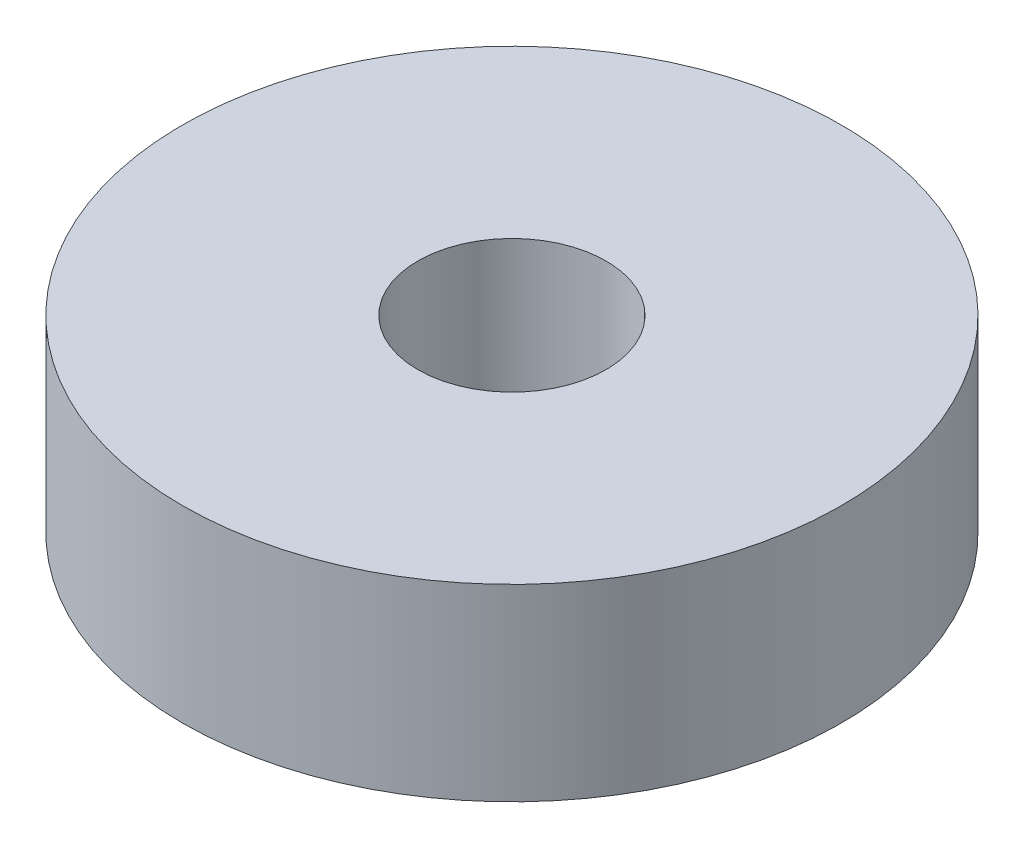
ISO-10303-21;
HEADER;
FILE_DESCRIPTION(('STEP AP214'),'2;1');
FILE_NAME('part.step','',(''),(''),'','','');
FILE_SCHEMA(('AUTOMOTIVE_DESIGN { 1 0 10303 214 1 1 1 1 }'));
ENDSEC;
DATA;
#1=APPLICATION_CONTEXT('core data for automotive mechanical design processes');
#2=APPLICATION_PROTOCOL_DEFINITION('international standard','automotive_design',2000,#1);
#3=PRODUCT_CONTEXT('',#1,'mechanical');
#4=PRODUCT('Part','Part','',(#3));
#5=PRODUCT_RELATED_PRODUCT_CATEGORY('part','',(#4));
#6=PRODUCT_DEFINITION_FORMATION('','',#4);
#7=PRODUCT_DEFINITION_CONTEXT('part definition',#1,'design');
#8=PRODUCT_DEFINITION('design','',#6,#7);
#9=PRODUCT_DEFINITION_SHAPE('','',#8);
#10=(LENGTH_UNIT() NAMED_UNIT(*) SI_UNIT(.MILLI.,.METRE.));
#11=(NAMED_UNIT(*) PLANE_ANGLE_UNIT() SI_UNIT($,.RADIAN.));
#12=(NAMED_UNIT(*) SI_UNIT($,.STERADIAN.) SOLID_ANGLE_UNIT());
#13=UNCERTAINTY_MEASURE_WITH_UNIT(LENGTH_MEASURE(1.E-05),#10,'distance_accuracy_value','');
#14=(GEOMETRIC_REPRESENTATION_CONTEXT(3) GLOBAL_UNCERTAINTY_ASSIGNED_CONTEXT((#13)) GLOBAL_UNIT_ASSIGNED_CONTEXT((#10,
#11,#12)) REPRESENTATION_CONTEXT('',''));
#15=CARTESIAN_POINT('',(0.,0.,0.));
#16=DIRECTION('',(0.,0.,1.));
#17=DIRECTION('',(1.,0.,0.));
#18=AXIS2_PLACEMENT_3D('',#15,#16,#17);
#19=CARTESIAN_POINT('',(0.,4.,0.));
#20=DIRECTION('',(0.,1.,0.));
#21=DIRECTION('',(0.,0.,1.));
#22=AXIS2_PLACEMENT_3D('',#19,#20,#21);
#23=PLANE('',#22);
#24=CARTESIAN_POINT('',(0.,4.,0.));
#25=DIRECTION('',(0.,1.,0.));
#26=DIRECTION('',(0.,0.,1.));
#27=AXIS2_PLACEMENT_3D('',#24,#25,#26);
#28=CIRCLE('',#27,7.);
#29=CARTESIAN_POINT('',(0.,4.,7.));
#30=VERTEX_POINT('',#29);
#31=EDGE_CURVE('E10',#30,#30,#28,.T.);
#32=ORIENTED_EDGE('',*,*,#31,.T.);
#33=EDGE_LOOP('',(#32));
#34=FACE_BOUND('',#33,.T.);
#35=CARTESIAN_POINT('',(0.,4.,0.));
#36=DIRECTION('',(0.,1.,0.));
#37=DIRECTION('',(0.,0.,1.));
#38=AXIS2_PLACEMENT_3D('',#35,#36,#37);
#39=CIRCLE('',#38,2.);
#40=CARTESIAN_POINT('',(0.,4.,2.));
#41=VERTEX_POINT('',#40);
#42=EDGE_CURVE('E50',#41,#41,#39,.T.);
#43=ORIENTED_EDGE('',*,*,#42,.F.);
#44=EDGE_LOOP('',(#43));
#45=FACE_BOUND('',#44,.T.);
#46=ADVANCED_FACE('F37',(#34,#45),#23,.T.);
#47=CARTESIAN_POINT('',(0.,0.,0.));
#48=DIRECTION('',(0.,1.,0.));
#49=DIRECTION('',(0.,0.,1.));
#50=AXIS2_PLACEMENT_3D('',#47,#48,#49);
#51=PLANE('',#50);
#52=CARTESIAN_POINT('',(0.,0.,0.));
#53=DIRECTION('',(0.,1.,0.));
#54=DIRECTION('',(0.,0.,1.));
#55=AXIS2_PLACEMENT_3D('',#52,#53,#54);
#56=CIRCLE('',#55,7.);
#57=CARTESIAN_POINT('',(0.,0.,7.));
#58=VERTEX_POINT('',#57);
#59=EDGE_CURVE('E41',#58,#58,#56,.T.);
#60=ORIENTED_EDGE('',*,*,#59,.F.);
#61=EDGE_LOOP('',(#60));
#62=FACE_BOUND('',#61,.T.);
#63=CARTESIAN_POINT('',(0.,0.,0.));
#64=DIRECTION('',(0.,1.,0.));
#65=DIRECTION('',(0.,0.,1.));
#66=AXIS2_PLACEMENT_3D('',#63,#64,#65);
#67=CIRCLE('',#66,2.);
#68=CARTESIAN_POINT('',(0.,0.,2.));
#69=VERTEX_POINT('',#68);
#70=EDGE_CURVE('E52',#69,#69,#67,.T.);
#71=ORIENTED_EDGE('',*,*,#70,.T.);
#72=EDGE_LOOP('',(#71));
#73=FACE_BOUND('',#72,.T.);
#74=ADVANCED_FACE('F64',(#62,#73),#51,.F.);
#75=CARTESIAN_POINT('',(0.,4.,0.));
#76=DIRECTION('',(0.,-1.,0.));
#77=DIRECTION('',(0.,0.,-1.));
#78=AXIS2_PLACEMENT_3D('',#75,#76,#77);
#79=CYLINDRICAL_SURFACE('',#78,7.);
#80=ORIENTED_EDGE('',*,*,#31,.F.);
#81=EDGE_LOOP('',(#80));
#82=FACE_BOUND('',#81,.T.);
#83=ORIENTED_EDGE('',*,*,#59,.T.);
#84=EDGE_LOOP('',(#83));
#85=FACE_BOUND('',#84,.T.);
#86=ADVANCED_FACE('F39',(#82,#85),#79,.T.);
#87=CARTESIAN_POINT('',(0.,4.,0.));
#88=DIRECTION('',(0.,-1.,0.));
#89=DIRECTION('',(0.,0.,-1.));
#90=AXIS2_PLACEMENT_3D('',#87,#88,#89);
#91=CYLINDRICAL_SURFACE('',#90,2.);
#92=ORIENTED_EDGE('',*,*,#42,.T.);
#93=EDGE_LOOP('',(#92));
#94=FACE_BOUND('',#93,.T.);
#95=ORIENTED_EDGE('',*,*,#70,.F.);
#96=EDGE_LOOP('',(#95));
#97=FACE_BOUND('',#96,.T.);
#98=ADVANCED_FACE('F60',(#94,#97),#91,.F.);
#99=CLOSED_SHELL('',(#46,#74,#86,#98));
#100=MANIFOLD_SOLID_BREP('B2',#99);
#101=ADVANCED_BREP_SHAPE_REPRESENTATION('',(#18,#100),#14);
#102=SHAPE_DEFINITION_REPRESENTATION(#9,#101);
ENDSEC;
END-ISO-10303-21;
